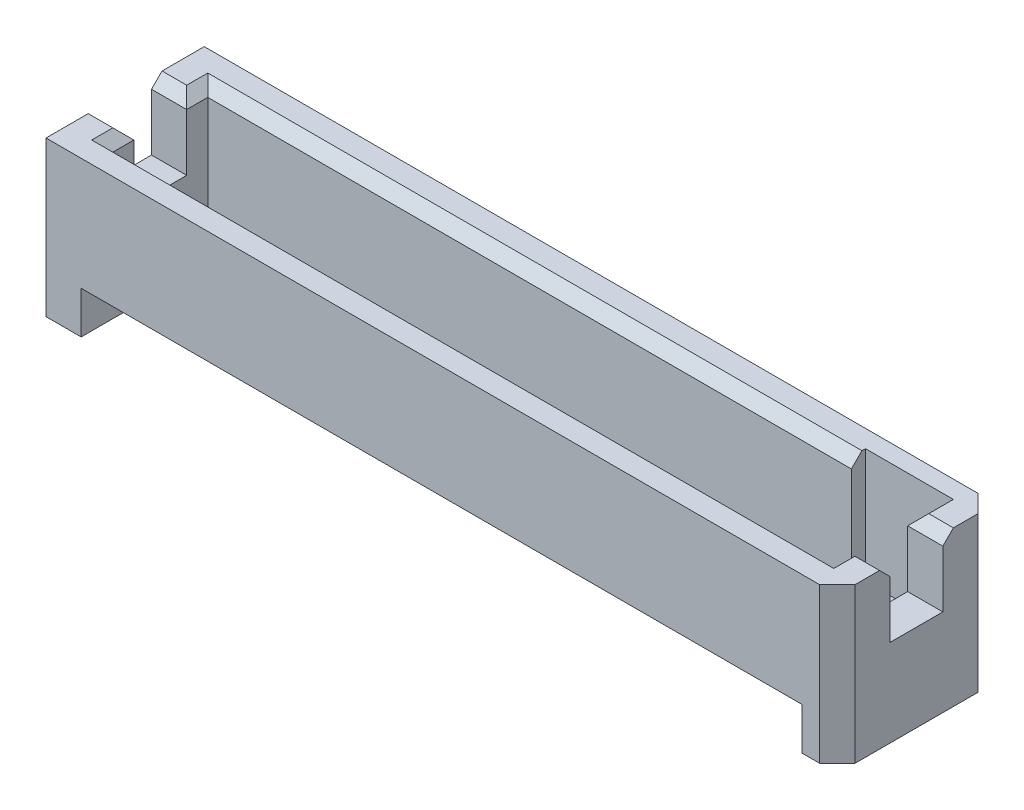
ISO-10303-21;
HEADER;
FILE_DESCRIPTION(('STEP AP214'),'2;1');
FILE_NAME('part.step','',(''),(''),'','','');
FILE_SCHEMA(('AUTOMOTIVE_DESIGN { 1 0 10303 214 1 1 1 1 }'));
ENDSEC;
DATA;
#1=APPLICATION_CONTEXT('core data for automotive mechanical design processes');
#2=APPLICATION_PROTOCOL_DEFINITION('international standard','automotive_design',2000,#1);
#3=PRODUCT_CONTEXT('',#1,'mechanical');
#4=PRODUCT('Part','Part','',(#3));
#5=PRODUCT_RELATED_PRODUCT_CATEGORY('part','',(#4));
#6=PRODUCT_DEFINITION_FORMATION('','',#4);
#7=PRODUCT_DEFINITION_CONTEXT('part definition',#1,'design');
#8=PRODUCT_DEFINITION('design','',#6,#7);
#9=PRODUCT_DEFINITION_SHAPE('','',#8);
#10=(LENGTH_UNIT() NAMED_UNIT(*) SI_UNIT(.MILLI.,.METRE.));
#11=(NAMED_UNIT(*) PLANE_ANGLE_UNIT() SI_UNIT($,.RADIAN.));
#12=(NAMED_UNIT(*) SI_UNIT($,.STERADIAN.) SOLID_ANGLE_UNIT());
#13=UNCERTAINTY_MEASURE_WITH_UNIT(LENGTH_MEASURE(1.E-05),#10,'distance_accuracy_value','');
#14=(GEOMETRIC_REPRESENTATION_CONTEXT(3) GLOBAL_UNCERTAINTY_ASSIGNED_CONTEXT((#13)) GLOBAL_UNIT_ASSIGNED_CONTEXT((#10,
#11,#12)) REPRESENTATION_CONTEXT('',''));
#15=CARTESIAN_POINT('',(0.,0.,0.));
#16=DIRECTION('',(0.,0.,1.));
#17=DIRECTION('',(1.,0.,0.));
#18=AXIS2_PLACEMENT_3D('',#15,#16,#17);
#19=CARTESIAN_POINT('',(13.6525,5.58800000000002,2.8575));
#20=DIRECTION('',(-0.707106781186545,0.,-0.707106781186547));
#21=DIRECTION('',(-0.707106781186548,0.,0.707106781186547));
#22=AXIS2_PLACEMENT_3D('',#19,#20,#21);
#23=PLANE('',#22);
#24=DIRECTION('',(0.707106781186548,0.,-0.707106781186547));
#25=VECTOR('',#24,1.);
#26=CARTESIAN_POINT('',(13.6525,0.,2.8575));
#27=LINE('',#26,#25);
#28=CARTESIAN_POINT('',(13.6525,0.,2.8575));
#29=VERTEX_POINT('',#28);
#30=CARTESIAN_POINT('',(14.2875,0.,2.2225));
#31=VERTEX_POINT('',#30);
#32=EDGE_CURVE('E11',#29,#31,#27,.T.);
#33=ORIENTED_EDGE('',*,*,#32,.T.);
#34=DIRECTION('',(0.,-1.,0.));
#35=VECTOR('',#34,1.);
#36=CARTESIAN_POINT('',(14.2875,5.588,2.2225));
#37=LINE('',#36,#35);
#38=CARTESIAN_POINT('',(14.2875,5.588,2.2225));
#39=VERTEX_POINT('',#38);
#40=EDGE_CURVE('E24',#39,#31,#37,.T.);
#41=ORIENTED_EDGE('',*,*,#40,.F.);
#42=DIRECTION('',(0.707106781186548,0.,-0.707106781186547));
#43=VECTOR('',#42,1.);
#44=CARTESIAN_POINT('',(13.6525,5.58800000000002,2.8575));
#45=LINE('',#44,#43);
#46=CARTESIAN_POINT('',(13.6525,5.58800000000002,2.8575));
#47=VERTEX_POINT('',#46);
#48=EDGE_CURVE('E660',#47,#39,#45,.T.);
#49=ORIENTED_EDGE('',*,*,#48,.F.);
#50=DIRECTION('',(0.,-1.,0.));
#51=VECTOR('',#50,1.);
#52=CARTESIAN_POINT('',(13.6525,5.58800000000002,2.8575));
#53=LINE('',#52,#51);
#54=EDGE_CURVE('E656',#47,#29,#53,.T.);
#55=ORIENTED_EDGE('',*,*,#54,.T.);
#56=EDGE_LOOP('',(#33,#41,#49,#55));
#57=FACE_BOUND('',#56,.T.);
#58=ADVANCED_FACE('F16',(#57),#23,.F.);
#59=CARTESIAN_POINT('',(-14.2875,5.58800000000002,2.85750000000001));
#60=DIRECTION('',(0.,0.,-1.));
#61=DIRECTION('',(-0.999999999999999,0.,0.));
#62=AXIS2_PLACEMENT_3D('',#59,#60,#61);
#63=PLANE('',#62);
#64=DIRECTION('',(-0.999999999999999,0.,0.));
#65=VECTOR('',#64,1.);
#66=CARTESIAN_POINT('',(13.0175,1.52400000000002,2.8575));
#67=LINE('',#66,#65);
#68=CARTESIAN_POINT('',(13.0175,1.52400000000002,2.8575));
#69=VERTEX_POINT('',#68);
#70=CARTESIAN_POINT('',(-13.0175,1.524,2.85750000000004));
#71=VERTEX_POINT('',#70);
#72=EDGE_CURVE('E651',#69,#71,#67,.T.);
#73=ORIENTED_EDGE('',*,*,#72,.F.);
#74=DIRECTION('',(0.,-1.,0.));
#75=VECTOR('',#74,1.);
#76=CARTESIAN_POINT('',(13.0175,1.52400000000002,2.8575));
#77=LINE('',#76,#75);
#78=CARTESIAN_POINT('',(13.0175,0.,2.8575));
#79=VERTEX_POINT('',#78);
#80=EDGE_CURVE('E647',#69,#79,#77,.T.);
#81=ORIENTED_EDGE('',*,*,#80,.T.);
#82=DIRECTION('',(0.999999999999999,0.,0.));
#83=VECTOR('',#82,1.);
#84=CARTESIAN_POINT('',(-14.2875,0.,2.85750000000004));
#85=LINE('',#84,#83);
#86=EDGE_CURVE('E642',#79,#29,#85,.T.);
#87=ORIENTED_EDGE('',*,*,#86,.T.);
#88=ORIENTED_EDGE('',*,*,#54,.F.);
#89=DIRECTION('',(0.999999999999999,0.,0.));
#90=VECTOR('',#89,1.);
#91=CARTESIAN_POINT('',(-14.2875,5.58800000000002,2.85750000000001));
#92=LINE('',#91,#90);
#93=CARTESIAN_POINT('',(-14.2875,5.58800000000002,2.85750000000001));
#94=VERTEX_POINT('',#93);
#95=EDGE_CURVE('E637',#94,#47,#92,.T.);
#96=ORIENTED_EDGE('',*,*,#95,.F.);
#97=DIRECTION('',(0.,-1.,0.));
#98=VECTOR('',#97,1.);
#99=CARTESIAN_POINT('',(-14.2875,5.58800000000002,2.85750000000001));
#100=LINE('',#99,#98);
#101=CARTESIAN_POINT('',(-14.2875,0.,2.85750000000004));
#102=VERTEX_POINT('',#101);
#103=EDGE_CURVE('E633',#94,#102,#100,.T.);
#104=ORIENTED_EDGE('',*,*,#103,.T.);
#105=DIRECTION('',(0.999999999999999,0.,0.));
#106=VECTOR('',#105,1.);
#107=CARTESIAN_POINT('',(-14.2875,0.,2.85750000000004));
#108=LINE('',#107,#106);
#109=CARTESIAN_POINT('',(-13.0175,0.,2.85750000000004));
#110=VERTEX_POINT('',#109);
#111=EDGE_CURVE('E629',#102,#110,#108,.T.);
#112=ORIENTED_EDGE('',*,*,#111,.T.);
#113=DIRECTION('',(0.,-1.,0.));
#114=VECTOR('',#113,1.);
#115=CARTESIAN_POINT('',(-13.0175,1.524,2.85750000000004));
#116=LINE('',#115,#114);
#117=EDGE_CURVE('E624',#71,#110,#116,.T.);
#118=ORIENTED_EDGE('',*,*,#117,.F.);
#119=EDGE_LOOP('',(#73,#81,#87,#88,#96,#104,#112,#118));
#120=FACE_BOUND('',#119,.T.);
#121=ADVANCED_FACE('F676',(#120),#63,.F.);
#122=CARTESIAN_POINT('',(-13.0175,0.,0.));
#123=DIRECTION('',(0.999999999999999,0.,0.));
#124=DIRECTION('',(0.,0.,-1.));
#125=AXIS2_PLACEMENT_3D('',#122,#123,#124);
#126=PLANE('',#125);
#127=DIRECTION('',(0.,0.496138938356834,0.868243142124459));
#128=VECTOR('',#127,1.);
#129=CARTESIAN_POINT('',(-13.0175,0.507999999999981,1.07950000000002));
#130=LINE('',#129,#128);
#131=CARTESIAN_POINT('',(-13.0175,0.507999999999981,1.07950000000002));
#132=VERTEX_POINT('',#131);
#133=EDGE_CURVE('E619',#132,#71,#130,.T.);
#134=ORIENTED_EDGE('',*,*,#133,.T.);
#135=ORIENTED_EDGE('',*,*,#117,.T.);
#136=DIRECTION('',(0.,0.,-1.));
#137=VECTOR('',#136,1.);
#138=CARTESIAN_POINT('',(-13.0175,0.,2.85750000000004));
#139=LINE('',#138,#137);
#140=CARTESIAN_POINT('',(-13.0175,0.,-2.85749999999996));
#141=VERTEX_POINT('',#140);
#142=EDGE_CURVE('E615',#110,#141,#139,.T.);
#143=ORIENTED_EDGE('',*,*,#142,.T.);
#144=DIRECTION('',(0.,1.,0.));
#145=VECTOR('',#144,1.);
#146=CARTESIAN_POINT('',(-13.0175,0.,-2.85749999999996));
#147=LINE('',#146,#145);
#148=CARTESIAN_POINT('',(-13.0175,1.524,-2.85749999999996));
#149=VERTEX_POINT('',#148);
#150=EDGE_CURVE('E611',#141,#149,#147,.T.);
#151=ORIENTED_EDGE('',*,*,#150,.T.);
#152=DIRECTION('',(0.,-0.496138938356834,0.868243142124459));
#153=VECTOR('',#152,1.);
#154=CARTESIAN_POINT('',(-13.0175,1.524,-2.85749999999996));
#155=LINE('',#154,#153);
#156=CARTESIAN_POINT('',(-13.0175,0.508000000000002,-1.07949999999997));
#157=VERTEX_POINT('',#156);
#158=EDGE_CURVE('E607',#149,#157,#155,.T.);
#159=ORIENTED_EDGE('',*,*,#158,.T.);
#160=DIRECTION('',(0.,0.,1.));
#161=VECTOR('',#160,1.);
#162=CARTESIAN_POINT('',(-13.0175,0.508000000000002,-1.07949999999997));
#163=LINE('',#162,#161);
#164=EDGE_CURVE('E603',#157,#132,#163,.T.);
#165=ORIENTED_EDGE('',*,*,#164,.T.);
#166=EDGE_LOOP('',(#134,#135,#143,#151,#159,#165));
#167=FACE_BOUND('',#166,.T.);
#168=ADVANCED_FACE('F806',(#167),#126,.T.);
#169=CARTESIAN_POINT('',(13.0175,0.508000000000029,-1.0795));
#170=DIRECTION('',(0.,-1.,0.));
#171=DIRECTION('',(0.,0.,-1.));
#172=AXIS2_PLACEMENT_3D('',#169,#170,#171);
#173=PLANE('',#172);
#174=ORIENTED_EDGE('',*,*,#164,.F.);
#175=DIRECTION('',(-0.999999999999999,0.,0.));
#176=VECTOR('',#175,1.);
#177=CARTESIAN_POINT('',(13.0175,0.508000000000029,-1.0795));
#178=LINE('',#177,#176);
#179=CARTESIAN_POINT('',(13.0175,0.508000000000029,-1.0795));
#180=VERTEX_POINT('',#179);
#181=EDGE_CURVE('E598',#180,#157,#178,.T.);
#182=ORIENTED_EDGE('',*,*,#181,.F.);
#183=DIRECTION('',(0.,0.,1.));
#184=VECTOR('',#183,1.);
#185=CARTESIAN_POINT('',(13.0175,0.508000000000029,-1.0795));
#186=LINE('',#185,#184);
#187=CARTESIAN_POINT('',(13.0175,0.508000000000008,1.0795));
#188=VERTEX_POINT('',#187);
#189=EDGE_CURVE('E594',#180,#188,#186,.T.);
#190=ORIENTED_EDGE('',*,*,#189,.T.);
#191=DIRECTION('',(-0.999999999999999,0.,0.));
#192=VECTOR('',#191,1.);
#193=CARTESIAN_POINT('',(13.0175,0.508000000000008,1.0795));
#194=LINE('',#193,#192);
#195=EDGE_CURVE('E589',#188,#132,#194,.T.);
#196=ORIENTED_EDGE('',*,*,#195,.T.);
#197=EDGE_LOOP('',(#174,#182,#190,#196));
#198=FACE_BOUND('',#197,.T.);
#199=ADVANCED_FACE('F810',(#198),#173,.T.);
#200=CARTESIAN_POINT('',(13.0175,0.508000000000008,1.0795));
#201=DIRECTION('',(0.,-0.868243142124459,0.496138938356834));
#202=DIRECTION('',(0.,-0.496138938356834,-0.868243142124459));
#203=AXIS2_PLACEMENT_3D('',#200,#201,#202);
#204=PLANE('',#203);
#205=ORIENTED_EDGE('',*,*,#133,.F.);
#206=ORIENTED_EDGE('',*,*,#195,.F.);
#207=DIRECTION('',(0.,0.496138938356834,0.868243142124459));
#208=VECTOR('',#207,1.);
#209=CARTESIAN_POINT('',(13.0175,0.508000000000008,1.0795));
#210=LINE('',#209,#208);
#211=EDGE_CURVE('E584',#188,#69,#210,.T.);
#212=ORIENTED_EDGE('',*,*,#211,.T.);
#213=ORIENTED_EDGE('',*,*,#72,.T.);
#214=EDGE_LOOP('',(#205,#206,#212,#213));
#215=FACE_BOUND('',#214,.T.);
#216=ADVANCED_FACE('F816',(#215),#204,.T.);
#217=CARTESIAN_POINT('',(13.0175,0.,0.));
#218=DIRECTION('',(0.999999999999999,0.,0.));
#219=DIRECTION('',(0.,0.,-1.));
#220=AXIS2_PLACEMENT_3D('',#217,#218,#219);
#221=PLANE('',#220);
#222=ORIENTED_EDGE('',*,*,#211,.F.);
#223=ORIENTED_EDGE('',*,*,#189,.F.);
#224=DIRECTION('',(0.,-0.496138938356834,0.868243142124459));
#225=VECTOR('',#224,1.);
#226=CARTESIAN_POINT('',(13.0175,1.524,-2.8575));
#227=LINE('',#226,#225);
#228=CARTESIAN_POINT('',(13.0175,1.524,-2.8575));
#229=VERTEX_POINT('',#228);
#230=EDGE_CURVE('E579',#229,#180,#227,.T.);
#231=ORIENTED_EDGE('',*,*,#230,.F.);
#232=DIRECTION('',(0.,1.,0.));
#233=VECTOR('',#232,1.);
#234=CARTESIAN_POINT('',(13.0175,0.,-2.8575));
#235=LINE('',#234,#233);
#236=CARTESIAN_POINT('',(13.0175,0.,-2.8575));
#237=VERTEX_POINT('',#236);
#238=EDGE_CURVE('E574',#237,#229,#235,.T.);
#239=ORIENTED_EDGE('',*,*,#238,.F.);
#240=DIRECTION('',(0.,0.,-1.));
#241=VECTOR('',#240,1.);
#242=CARTESIAN_POINT('',(13.0175,0.,2.8575));
#243=LINE('',#242,#241);
#244=EDGE_CURVE('E569',#79,#237,#243,.T.);
#245=ORIENTED_EDGE('',*,*,#244,.F.);
#246=ORIENTED_EDGE('',*,*,#80,.F.);
#247=EDGE_LOOP('',(#222,#223,#231,#239,#245,#246));
#248=FACE_BOUND('',#247,.T.);
#249=ADVANCED_FACE('F820',(#248),#221,.F.);
#250=CARTESIAN_POINT('',(0.,0.,0.));
#251=DIRECTION('',(0.,1.,0.));
#252=DIRECTION('',(0.,0.,1.));
#253=AXIS2_PLACEMENT_3D('',#250,#251,#252);
#254=PLANE('',#253);
#255=ORIENTED_EDGE('',*,*,#86,.F.);
#256=ORIENTED_EDGE('',*,*,#244,.T.);
#257=DIRECTION('',(-0.999999999999999,0.,0.));
#258=VECTOR('',#257,1.);
#259=CARTESIAN_POINT('',(13.6525,0.,-2.8575));
#260=LINE('',#259,#258);
#261=CARTESIAN_POINT('',(13.6525,0.,-2.8575));
#262=VERTEX_POINT('',#261);
#263=EDGE_CURVE('E564',#262,#237,#260,.T.);
#264=ORIENTED_EDGE('',*,*,#263,.F.);
#265=DIRECTION('',(-0.707106781186546,0.,-0.707106781186546));
#266=VECTOR('',#265,1.);
#267=CARTESIAN_POINT('',(14.2875,0.,-2.2225));
#268=LINE('',#267,#266);
#269=CARTESIAN_POINT('',(14.2875,0.,-2.2225));
#270=VERTEX_POINT('',#269);
#271=EDGE_CURVE('E559',#270,#262,#268,.T.);
#272=ORIENTED_EDGE('',*,*,#271,.F.);
#273=DIRECTION('',(0.,0.,-1.));
#274=VECTOR('',#273,1.);
#275=CARTESIAN_POINT('',(14.2875,0.,2.2225));
#276=LINE('',#275,#274);
#277=EDGE_CURVE('E554',#31,#270,#276,.T.);
#278=ORIENTED_EDGE('',*,*,#277,.F.);
#279=ORIENTED_EDGE('',*,*,#32,.F.);
#280=EDGE_LOOP('',(#255,#256,#264,#272,#278,#279));
#281=FACE_BOUND('',#280,.T.);
#282=ADVANCED_FACE('F681',(#281),#254,.F.);
#283=CARTESIAN_POINT('',(14.2875,5.588,2.2225));
#284=DIRECTION('',(-0.999999999999999,0.,0.));
#285=DIRECTION('',(0.,0.,1.));
#286=AXIS2_PLACEMENT_3D('',#283,#284,#285);
#287=PLANE('',#286);
#288=DIRECTION('',(0.,-0.707106781186548,-0.707106781186547));
#289=VECTOR('',#288,1.);
#290=CARTESIAN_POINT('',(14.2875,5.588,1.3335));
#291=LINE('',#290,#289);
#292=CARTESIAN_POINT('',(14.2875,5.588,1.3335));
#293=VERTEX_POINT('',#292);
#294=CARTESIAN_POINT('',(14.2875,5.207,0.952500000000009));
#295=VERTEX_POINT('',#294);
#296=EDGE_CURVE('E549',#293,#295,#291,.T.);
#297=ORIENTED_EDGE('',*,*,#296,.F.);
#298=DIRECTION('',(0.,0.,-1.));
#299=VECTOR('',#298,1.);
#300=CARTESIAN_POINT('',(14.2875,5.588,2.2225));
#301=LINE('',#300,#299);
#302=EDGE_CURVE('E544',#39,#293,#301,.T.);
#303=ORIENTED_EDGE('',*,*,#302,.F.);
#304=ORIENTED_EDGE('',*,*,#40,.T.);
#305=ORIENTED_EDGE('',*,*,#277,.T.);
#306=DIRECTION('',(0.,-1.,0.));
#307=VECTOR('',#306,1.);
#308=CARTESIAN_POINT('',(14.2875,5.58799999999998,-2.2225));
#309=LINE('',#308,#307);
#310=CARTESIAN_POINT('',(14.2875,5.58799999999998,-2.2225));
#311=VERTEX_POINT('',#310);
#312=EDGE_CURVE('E539',#311,#270,#309,.T.);
#313=ORIENTED_EDGE('',*,*,#312,.F.);
#314=DIRECTION('',(0.,0.,-1.));
#315=VECTOR('',#314,1.);
#316=CARTESIAN_POINT('',(14.2875,5.588,2.2225));
#317=LINE('',#316,#315);
#318=CARTESIAN_POINT('',(14.2875,5.588,-1.3335));
#319=VERTEX_POINT('',#318);
#320=EDGE_CURVE('E534',#319,#311,#317,.T.);
#321=ORIENTED_EDGE('',*,*,#320,.F.);
#322=DIRECTION('',(0.,0.707106781186548,-0.707106781186547));
#323=VECTOR('',#322,1.);
#324=CARTESIAN_POINT('',(14.2875,5.20699999999999,-0.952499999999995));
#325=LINE('',#324,#323);
#326=CARTESIAN_POINT('',(14.2875,5.20699999999999,-0.952499999999995));
#327=VERTEX_POINT('',#326);
#328=EDGE_CURVE('E529',#327,#319,#325,.T.);
#329=ORIENTED_EDGE('',*,*,#328,.F.);
#330=DIRECTION('',(0.,-1.,0.));
#331=VECTOR('',#330,1.);
#332=CARTESIAN_POINT('',(14.2875,8.02639999999999,-0.952499999999995));
#333=LINE('',#332,#331);
#334=CARTESIAN_POINT('',(14.2875,3.14959999999999,-0.952499999999995));
#335=VERTEX_POINT('',#334);
#336=EDGE_CURVE('E525',#327,#335,#333,.T.);
#337=ORIENTED_EDGE('',*,*,#336,.T.);
#338=DIRECTION('',(0.,0.,-1.));
#339=VECTOR('',#338,1.);
#340=CARTESIAN_POINT('',(14.2875,3.1496,0.952500000000009));
#341=LINE('',#340,#339);
#342=CARTESIAN_POINT('',(14.2875,3.1496,0.952500000000009));
#343=VERTEX_POINT('',#342);
#344=EDGE_CURVE('E520',#343,#335,#341,.T.);
#345=ORIENTED_EDGE('',*,*,#344,.F.);
#346=DIRECTION('',(0.,-1.,0.));
#347=VECTOR('',#346,1.);
#348=CARTESIAN_POINT('',(14.2875,8.0264,0.952500000000009));
#349=LINE('',#348,#347);
#350=EDGE_CURVE('E515',#295,#343,#349,.T.);
#351=ORIENTED_EDGE('',*,*,#350,.F.);
#352=EDGE_LOOP('',(#297,#303,#304,#305,#313,#321,#329,#337,#345,#351));
#353=FACE_BOUND('',#352,.T.);
#354=ADVANCED_FACE('F670',(#353),#287,.F.);
#355=CARTESIAN_POINT('',(-14.2875,8.02640000000003,0.952500000000023));
#356=DIRECTION('',(0.,0.,-1.));
#357=DIRECTION('',(-0.999999999999999,0.,0.));
#358=AXIS2_PLACEMENT_3D('',#355,#356,#357);
#359=PLANE('',#358);
#360=DIRECTION('',(0.,-1.,0.));
#361=VECTOR('',#360,1.);
#362=CARTESIAN_POINT('',(13.0175,8.02640000000002,0.952500000000009));
#363=LINE('',#362,#361);
#364=CARTESIAN_POINT('',(13.0175,5.20700000000002,0.952500000000009));
#365=VERTEX_POINT('',#364);
#366=CARTESIAN_POINT('',(13.0175,3.14960000000002,0.952500000000009));
#367=VERTEX_POINT('',#366);
#368=EDGE_CURVE('E510',#365,#367,#363,.T.);
#369=ORIENTED_EDGE('',*,*,#368,.F.);
#370=DIRECTION('',(-0.999999999999999,0.,0.));
#371=VECTOR('',#370,1.);
#372=CARTESIAN_POINT('',(14.2875,5.207,0.952500000000009));
#373=LINE('',#372,#371);
#374=EDGE_CURVE('E505',#295,#365,#373,.T.);
#375=ORIENTED_EDGE('',*,*,#374,.F.);
#376=ORIENTED_EDGE('',*,*,#350,.T.);
#377=DIRECTION('',(0.999999999999999,0.,0.));
#378=VECTOR('',#377,1.);
#379=CARTESIAN_POINT('',(-14.2875,3.14960000000003,0.952500000000023));
#380=LINE('',#379,#378);
#381=EDGE_CURVE('E500',#367,#343,#380,.T.);
#382=ORIENTED_EDGE('',*,*,#381,.F.);
#383=EDGE_LOOP('',(#369,#375,#376,#382));
#384=FACE_BOUND('',#383,.T.);
#385=ADVANCED_FACE('F790',(#384),#359,.T.);
#386=CARTESIAN_POINT('',(0.,3.1496,0.));
#387=DIRECTION('',(0.,1.,0.));
#388=DIRECTION('',(0.,0.,1.));
#389=AXIS2_PLACEMENT_3D('',#386,#387,#388);
#390=PLANE('',#389);
#391=DIRECTION('',(0.,0.,-1.));
#392=VECTOR('',#391,1.);
#393=CARTESIAN_POINT('',(13.0175,3.14960000000001,0.));
#394=LINE('',#393,#392);
#395=CARTESIAN_POINT('',(13.0175,3.14960000000002,-0.952499999999995));
#396=VERTEX_POINT('',#395);
#397=EDGE_CURVE('E495',#367,#396,#394,.T.);
#398=ORIENTED_EDGE('',*,*,#397,.F.);
#399=ORIENTED_EDGE('',*,*,#381,.T.);
#400=ORIENTED_EDGE('',*,*,#344,.T.);
#401=DIRECTION('',(-0.999999999999999,0.,0.));
#402=VECTOR('',#401,1.);
#403=CARTESIAN_POINT('',(14.2875,3.14959999999999,-0.952499999999995));
#404=LINE('',#403,#402);
#405=EDGE_CURVE('E491',#335,#396,#404,.T.);
#406=ORIENTED_EDGE('',*,*,#405,.T.);
#407=EDGE_LOOP('',(#398,#399,#400,#406));
#408=FACE_BOUND('',#407,.T.);
#409=ADVANCED_FACE('F792',(#408),#390,.T.);
#410=CARTESIAN_POINT('',(14.2875,8.02639999999999,-0.952499999999995));
#411=DIRECTION('',(0.,0.,1.));
#412=DIRECTION('',(0.999999999999999,0.,0.));
#413=AXIS2_PLACEMENT_3D('',#410,#411,#412);
#414=PLANE('',#413);
#415=ORIENTED_EDGE('',*,*,#336,.F.);
#416=DIRECTION('',(-0.999999999999999,0.,0.));
#417=VECTOR('',#416,1.);
#418=CARTESIAN_POINT('',(14.2875,5.20699999999999,-0.952499999999995));
#419=LINE('',#418,#417);
#420=CARTESIAN_POINT('',(13.0175,5.20700000000002,-0.952499999999995));
#421=VERTEX_POINT('',#420);
#422=EDGE_CURVE('E487',#327,#421,#419,.T.);
#423=ORIENTED_EDGE('',*,*,#422,.T.);
#424=DIRECTION('',(0.,1.,0.));
#425=VECTOR('',#424,1.);
#426=CARTESIAN_POINT('',(13.0175,8.02640000000002,-0.952499999999995));
#427=LINE('',#426,#425);
#428=EDGE_CURVE('E482',#396,#421,#427,.T.);
#429=ORIENTED_EDGE('',*,*,#428,.F.);
#430=ORIENTED_EDGE('',*,*,#405,.F.);
#431=EDGE_LOOP('',(#415,#423,#429,#430));
#432=FACE_BOUND('',#431,.T.);
#433=ADVANCED_FACE('F697',(#432),#414,.T.);
#434=CARTESIAN_POINT('',(13.0175,1.43510000000002,1.71450000000001));
#435=DIRECTION('',(0.999999999999999,0.,0.));
#436=DIRECTION('',(0.,0.,-1.));
#437=AXIS2_PLACEMENT_3D('',#434,#435,#436);
#438=PLANE('',#437);
#439=ORIENTED_EDGE('',*,*,#397,.T.);
#440=ORIENTED_EDGE('',*,*,#428,.T.);
#441=DIRECTION('',(0.,0.,-1.));
#442=VECTOR('',#441,1.);
#443=CARTESIAN_POINT('',(13.0175,5.20700000000002,1.71450000000001));
#444=LINE('',#443,#442);
#445=CARTESIAN_POINT('',(13.0175,5.207,-2.2225));
#446=VERTEX_POINT('',#445);
#447=EDGE_CURVE('E478',#421,#446,#444,.T.);
#448=ORIENTED_EDGE('',*,*,#447,.T.);
#449=DIRECTION('',(0.,1.,0.));
#450=VECTOR('',#449,1.);
#451=CARTESIAN_POINT('',(13.0175,1.43510000000001,-2.2225));
#452=LINE('',#451,#450);
#453=CARTESIAN_POINT('',(13.0175,1.43510000000001,-2.2225));
#454=VERTEX_POINT('',#453);
#455=EDGE_CURVE('E474',#454,#446,#452,.T.);
#456=ORIENTED_EDGE('',*,*,#455,.F.);
#457=DIRECTION('',(0.,0.,-1.));
#458=VECTOR('',#457,1.);
#459=CARTESIAN_POINT('',(13.0175,1.43510000000002,1.71450000000001));
#460=LINE('',#459,#458);
#461=CARTESIAN_POINT('',(13.0175,1.43510000000002,1.71450000000001));
#462=VERTEX_POINT('',#461);
#463=EDGE_CURVE('E232',#462,#454,#460,.T.);
#464=ORIENTED_EDGE('',*,*,#463,.F.);
#465=DIRECTION('',(0.,1.,0.));
#466=VECTOR('',#465,1.);
#467=CARTESIAN_POINT('',(13.0175,1.43510000000002,1.71450000000001));
#468=LINE('',#467,#466);
#469=CARTESIAN_POINT('',(13.0175,5.20700000000002,1.71450000000001));
#470=VERTEX_POINT('',#469);
#471=EDGE_CURVE('E467',#462,#470,#468,.T.);
#472=ORIENTED_EDGE('',*,*,#471,.T.);
#473=DIRECTION('',(0.,0.,-1.));
#474=VECTOR('',#473,1.);
#475=CARTESIAN_POINT('',(13.0175,5.20700000000002,1.71450000000001));
#476=LINE('',#475,#474);
#477=EDGE_CURVE('E462',#470,#365,#476,.T.);
#478=ORIENTED_EDGE('',*,*,#477,.T.);
#479=ORIENTED_EDGE('',*,*,#368,.T.);
#480=EDGE_LOOP('',(#439,#440,#448,#456,#464,#472,#478,#479));
#481=FACE_BOUND('',#480,.T.);
#482=ADVANCED_FACE('F701',(#481),#438,.F.);
#483=CARTESIAN_POINT('',(13.0175,5.20700000000002,1.71450000000001));
#484=DIRECTION('',(-0.707106781186547,0.707106781186547,0.));
#485=DIRECTION('',(-0.707106781186547,-0.707106781186547,0.));
#486=AXIS2_PLACEMENT_3D('',#483,#484,#485);
#487=PLANE('',#486);
#488=DIRECTION('',(0.,0.,-1.));
#489=VECTOR('',#488,1.);
#490=CARTESIAN_POINT('',(13.3985,5.58800000000002,1.71450000000001));
#491=LINE('',#490,#489);
#492=CARTESIAN_POINT('',(13.3985,5.588,2.0955));
#493=VERTEX_POINT('',#492);
#494=CARTESIAN_POINT('',(13.3985,5.588,1.3335));
#495=VERTEX_POINT('',#494);
#496=EDGE_CURVE('E458',#493,#495,#491,.T.);
#497=ORIENTED_EDGE('',*,*,#496,.T.);
#498=DIRECTION('',(-0.577350269189625,-0.577350269189626,-0.577350269189624));
#499=VECTOR('',#498,1.);
#500=CARTESIAN_POINT('',(13.2715,5.461,1.2065));
#501=LINE('',#500,#499);
#502=EDGE_CURVE('E453',#495,#365,#501,.T.);
#503=ORIENTED_EDGE('',*,*,#502,.T.);
#504=ORIENTED_EDGE('',*,*,#477,.F.);
#505=DIRECTION('',(-0.577350269189624,-0.577350269189625,-0.577350269189625));
#506=VECTOR('',#505,1.);
#507=CARTESIAN_POINT('',(13.0175,5.20700000000002,1.71450000000001));
#508=LINE('',#507,#506);
#509=EDGE_CURVE('E448',#493,#470,#508,.T.);
#510=ORIENTED_EDGE('',*,*,#509,.F.);
#511=EDGE_LOOP('',(#497,#503,#504,#510));
#512=FACE_BOUND('',#511,.T.);
#513=ADVANCED_FACE('F787',(#512),#487,.T.);
#514=CARTESIAN_POINT('',(-13.0175,5.207,1.71450000000002));
#515=DIRECTION('',(0.,0.707106781186547,-0.707106781186547));
#516=DIRECTION('',(0.,0.707106781186547,0.707106781186547));
#517=AXIS2_PLACEMENT_3D('',#514,#515,#516);
#518=PLANE('',#517);
#519=DIRECTION('',(0.999999999999999,0.,0.));
#520=VECTOR('',#519,1.);
#521=CARTESIAN_POINT('',(-13.0175,5.207,1.71450000000002));
#522=LINE('',#521,#520);
#523=CARTESIAN_POINT('',(-13.0175,5.207,1.71450000000002));
#524=VERTEX_POINT('',#523);
#525=EDGE_CURVE('E443',#524,#470,#522,.T.);
#526=ORIENTED_EDGE('',*,*,#525,.F.);
#527=DIRECTION('',(0.577350269189626,-0.577350269189625,-0.577350269189626));
#528=VECTOR('',#527,1.);
#529=CARTESIAN_POINT('',(-13.0175,5.207,1.71450000000002));
#530=LINE('',#529,#528);
#531=CARTESIAN_POINT('',(-13.3985,5.588,2.09550000000001));
#532=VERTEX_POINT('',#531);
#533=EDGE_CURVE('E438',#532,#524,#530,.T.);
#534=ORIENTED_EDGE('',*,*,#533,.F.);
#535=DIRECTION('',(0.999999999999999,0.,0.));
#536=VECTOR('',#535,1.);
#537=CARTESIAN_POINT('',(-13.0175,5.58800000000001,2.09550000000001));
#538=LINE('',#537,#536);
#539=EDGE_CURVE('E433',#532,#493,#538,.T.);
#540=ORIENTED_EDGE('',*,*,#539,.T.);
#541=ORIENTED_EDGE('',*,*,#509,.T.);
#542=EDGE_LOOP('',(#526,#534,#540,#541));
#543=FACE_BOUND('',#542,.T.);
#544=ADVANCED_FACE('F713',(#543),#518,.T.);
#545=CARTESIAN_POINT('',(0.,5.588,0.));
#546=DIRECTION('',(0.,1.,0.));
#547=DIRECTION('',(0.,0.,1.));
#548=AXIS2_PLACEMENT_3D('',#545,#546,#547);
#549=PLANE('',#548);
#550=ORIENTED_EDGE('',*,*,#302,.T.);
#551=DIRECTION('',(-0.999999999999999,0.,0.));
#552=VECTOR('',#551,1.);
#553=CARTESIAN_POINT('',(14.2875,5.588,1.3335));
#554=LINE('',#553,#552);
#555=EDGE_CURVE('E428',#293,#495,#554,.T.);
#556=ORIENTED_EDGE('',*,*,#555,.T.);
#557=ORIENTED_EDGE('',*,*,#496,.F.);
#558=ORIENTED_EDGE('',*,*,#539,.F.);
#559=DIRECTION('',(0.,0.,1.));
#560=VECTOR('',#559,1.);
#561=CARTESIAN_POINT('',(-13.3985,5.588,-1.71449999999998));
#562=LINE('',#561,#560);
#563=CARTESIAN_POINT('',(-13.3985,5.588,1.33350000000002));
#564=VERTEX_POINT('',#563);
#565=EDGE_CURVE('E423',#564,#532,#562,.T.);
#566=ORIENTED_EDGE('',*,*,#565,.F.);
#567=DIRECTION('',(-0.999999999999999,0.,0.));
#568=VECTOR('',#567,1.);
#569=CARTESIAN_POINT('',(14.2875,5.588,1.3335));
#570=LINE('',#569,#568);
#571=CARTESIAN_POINT('',(-14.2875,5.58800000000001,1.33350000000002));
#572=VERTEX_POINT('',#571);
#573=EDGE_CURVE('E419',#564,#572,#570,.T.);
#574=ORIENTED_EDGE('',*,*,#573,.T.);
#575=DIRECTION('',(0.,0.,1.));
#576=VECTOR('',#575,1.);
#577=CARTESIAN_POINT('',(-14.2875,5.58800000000001,-2.85749999999998));
#578=LINE('',#577,#576);
#579=EDGE_CURVE('E414',#572,#94,#578,.T.);
#580=ORIENTED_EDGE('',*,*,#579,.T.);
#581=ORIENTED_EDGE('',*,*,#95,.T.);
#582=ORIENTED_EDGE('',*,*,#48,.T.);
#583=EDGE_LOOP('',(#550,#556,#557,#558,#566,#574,#580,#581,#582));
#584=FACE_BOUND('',#583,.T.);
#585=ADVANCED_FACE('F673',(#584),#549,.T.);
#586=CARTESIAN_POINT('',(-14.2875,5.58800000000001,-2.85749999999998));
#587=DIRECTION('',(0.999999999999999,0.,0.));
#588=DIRECTION('',(0.,0.,-1.));
#589=AXIS2_PLACEMENT_3D('',#586,#587,#588);
#590=PLANE('',#589);
#591=DIRECTION('',(0.,-0.707106781186548,-0.707106781186547));
#592=VECTOR('',#591,1.);
#593=CARTESIAN_POINT('',(-14.2875,5.58800000000001,1.33350000000002));
#594=LINE('',#593,#592);
#595=CARTESIAN_POINT('',(-14.2875,5.20700000000003,0.952500000000023));
#596=VERTEX_POINT('',#595);
#597=EDGE_CURVE('E410',#572,#596,#594,.T.);
#598=ORIENTED_EDGE('',*,*,#597,.T.);
#599=DIRECTION('',(0.,-1.,0.));
#600=VECTOR('',#599,1.);
#601=CARTESIAN_POINT('',(-14.2875,8.02640000000003,0.952500000000023));
#602=LINE('',#601,#600);
#603=CARTESIAN_POINT('',(-14.2875,3.14960000000003,0.952500000000023));
#604=VERTEX_POINT('',#603);
#605=EDGE_CURVE('E406',#596,#604,#602,.T.);
#606=ORIENTED_EDGE('',*,*,#605,.T.);
#607=DIRECTION('',(0.,0.,1.));
#608=VECTOR('',#607,1.);
#609=CARTESIAN_POINT('',(-14.2875,3.14960000000002,-0.952499999999981));
#610=LINE('',#609,#608);
#611=CARTESIAN_POINT('',(-14.2875,3.14960000000002,-0.952499999999981));
#612=VERTEX_POINT('',#611);
#613=EDGE_CURVE('E401',#612,#604,#610,.T.);
#614=ORIENTED_EDGE('',*,*,#613,.F.);
#615=DIRECTION('',(0.,-1.,0.));
#616=VECTOR('',#615,1.);
#617=CARTESIAN_POINT('',(-14.2875,8.02640000000002,-0.952499999999981));
#618=LINE('',#617,#616);
#619=CARTESIAN_POINT('',(-14.2875,5.20700000000002,-0.952499999999981));
#620=VERTEX_POINT('',#619);
#621=EDGE_CURVE('E396',#620,#612,#618,.T.);
#622=ORIENTED_EDGE('',*,*,#621,.F.);
#623=DIRECTION('',(0.,0.707106781186548,-0.707106781186547));
#624=VECTOR('',#623,1.);
#625=CARTESIAN_POINT('',(-14.2875,5.20700000000002,-0.952499999999981));
#626=LINE('',#625,#624);
#627=CARTESIAN_POINT('',(-14.2875,5.58800000000001,-1.33349999999999));
#628=VERTEX_POINT('',#627);
#629=EDGE_CURVE('E392',#620,#628,#626,.T.);
#630=ORIENTED_EDGE('',*,*,#629,.T.);
#631=DIRECTION('',(0.,0.,1.));
#632=VECTOR('',#631,1.);
#633=CARTESIAN_POINT('',(-14.2875,5.58800000000001,-2.85749999999998));
#634=LINE('',#633,#632);
#635=CARTESIAN_POINT('',(-14.2875,5.58800000000001,-2.85749999999998));
#636=VERTEX_POINT('',#635);
#637=EDGE_CURVE('E387',#636,#628,#634,.T.);
#638=ORIENTED_EDGE('',*,*,#637,.F.);
#639=DIRECTION('',(0.,-1.,0.));
#640=VECTOR('',#639,1.);
#641=CARTESIAN_POINT('',(-14.2875,5.58800000000001,-2.85749999999998));
#642=LINE('',#641,#640);
#643=CARTESIAN_POINT('',(-14.2875,0.,-2.85749999999996));
#644=VERTEX_POINT('',#643);
#645=EDGE_CURVE('E383',#636,#644,#642,.T.);
#646=ORIENTED_EDGE('',*,*,#645,.T.);
#647=DIRECTION('',(0.,0.,1.));
#648=VECTOR('',#647,1.);
#649=CARTESIAN_POINT('',(-14.2875,0.,-2.85749999999996));
#650=LINE('',#649,#648);
#651=EDGE_CURVE('E378',#644,#102,#650,.T.);
#652=ORIENTED_EDGE('',*,*,#651,.T.);
#653=ORIENTED_EDGE('',*,*,#103,.F.);
#654=ORIENTED_EDGE('',*,*,#579,.F.);
#655=EDGE_LOOP('',(#598,#606,#614,#622,#630,#638,#646,#652,#653,#654));
#656=FACE_BOUND('',#655,.T.);
#657=ADVANCED_FACE('F781',(#656),#590,.F.);
#658=CARTESIAN_POINT('',(0.,0.,0.));
#659=DIRECTION('',(0.,1.,0.));
#660=DIRECTION('',(0.,0.,1.));
#661=AXIS2_PLACEMENT_3D('',#658,#659,#660);
#662=PLANE('',#661);
#663=ORIENTED_EDGE('',*,*,#142,.F.);
#664=ORIENTED_EDGE('',*,*,#111,.F.);
#665=ORIENTED_EDGE('',*,*,#651,.F.);
#666=DIRECTION('',(-0.999999999999999,0.,0.));
#667=VECTOR('',#666,1.);
#668=CARTESIAN_POINT('',(13.6525,0.,-2.8575));
#669=LINE('',#668,#667);
#670=EDGE_CURVE('E373',#141,#644,#669,.T.);
#671=ORIENTED_EDGE('',*,*,#670,.F.);
#672=EDGE_LOOP('',(#663,#664,#665,#671));
#673=FACE_BOUND('',#672,.T.);
#674=ADVANCED_FACE('F892',(#673),#662,.F.);
#675=CARTESIAN_POINT('',(13.6525,5.588,-2.8575));
#676=DIRECTION('',(0.,0.,1.));
#677=DIRECTION('',(0.999999999999999,0.,0.));
#678=AXIS2_PLACEMENT_3D('',#675,#676,#677);
#679=PLANE('',#678);
#680=ORIENTED_EDGE('',*,*,#263,.T.);
#681=ORIENTED_EDGE('',*,*,#238,.T.);
#682=DIRECTION('',(-0.999999999999999,0.,0.));
#683=VECTOR('',#682,1.);
#684=CARTESIAN_POINT('',(13.0175,1.524,-2.8575));
#685=LINE('',#684,#683);
#686=EDGE_CURVE('E368',#229,#149,#685,.T.);
#687=ORIENTED_EDGE('',*,*,#686,.T.);
#688=ORIENTED_EDGE('',*,*,#150,.F.);
#689=ORIENTED_EDGE('',*,*,#670,.T.);
#690=ORIENTED_EDGE('',*,*,#645,.F.);
#691=DIRECTION('',(-0.999999999999999,0.,0.));
#692=VECTOR('',#691,1.);
#693=CARTESIAN_POINT('',(13.6525,5.588,-2.8575));
#694=LINE('',#693,#692);
#695=CARTESIAN_POINT('',(13.6525,5.588,-2.8575));
#696=VERTEX_POINT('',#695);
#697=EDGE_CURVE('E363',#696,#636,#694,.T.);
#698=ORIENTED_EDGE('',*,*,#697,.F.);
#699=DIRECTION('',(0.,-1.,0.));
#700=VECTOR('',#699,1.);
#701=CARTESIAN_POINT('',(13.6525,5.588,-2.8575));
#702=LINE('',#701,#700);
#703=EDGE_CURVE('E358',#696,#262,#702,.T.);
#704=ORIENTED_EDGE('',*,*,#703,.T.);
#705=EDGE_LOOP('',(#680,#681,#687,#688,#689,#690,#698,#704));
#706=FACE_BOUND('',#705,.T.);
#707=ADVANCED_FACE('F901',(#706),#679,.F.);
#708=CARTESIAN_POINT('',(14.2875,5.58799999999998,-2.2225));
#709=DIRECTION('',(-0.707106781186547,0.,0.707106781186548));
#710=DIRECTION('',(0.707106781186546,0.,0.707106781186546));
#711=AXIS2_PLACEMENT_3D('',#708,#709,#710);
#712=PLANE('',#711);
#713=ORIENTED_EDGE('',*,*,#271,.T.);
#714=ORIENTED_EDGE('',*,*,#703,.F.);
#715=DIRECTION('',(-0.707106781186546,0.,-0.707106781186546));
#716=VECTOR('',#715,1.);
#717=CARTESIAN_POINT('',(14.2875,5.58799999999998,-2.2225));
#718=LINE('',#717,#716);
#719=EDGE_CURVE('E353',#311,#696,#718,.T.);
#720=ORIENTED_EDGE('',*,*,#719,.F.);
#721=ORIENTED_EDGE('',*,*,#312,.T.);
#722=EDGE_LOOP('',(#713,#714,#720,#721));
#723=FACE_BOUND('',#722,.T.);
#724=ADVANCED_FACE('F684',(#723),#712,.F.);
#725=CARTESIAN_POINT('',(0.,5.588,0.));
#726=DIRECTION('',(0.,1.,0.));
#727=DIRECTION('',(0.,0.,1.));
#728=AXIS2_PLACEMENT_3D('',#725,#726,#727);
#729=PLANE('',#728);
#730=DIRECTION('',(0.,0.,1.));
#731=VECTOR('',#730,1.);
#732=CARTESIAN_POINT('',(10.2235,5.58799999999998,-2.2225));
#733=LINE('',#732,#731);
#734=CARTESIAN_POINT('',(10.2235,5.58799999999998,-2.2225));
#735=VERTEX_POINT('',#734);
#736=CARTESIAN_POINT('',(10.2235,5.588,-2.0955));
#737=VERTEX_POINT('',#736);
#738=EDGE_CURVE('E349',#735,#737,#733,.T.);
#739=ORIENTED_EDGE('',*,*,#738,.F.);
#740=DIRECTION('',(-0.999999999999999,0.,0.));
#741=VECTOR('',#740,1.);
#742=CARTESIAN_POINT('',(13.3985,5.588,-2.2225));
#743=LINE('',#742,#741);
#744=CARTESIAN_POINT('',(13.3985,5.588,-2.2225));
#745=VERTEX_POINT('',#744);
#746=EDGE_CURVE('E251',#745,#735,#743,.T.);
#747=ORIENTED_EDGE('',*,*,#746,.F.);
#748=DIRECTION('',(0.,0.,-1.));
#749=VECTOR('',#748,1.);
#750=CARTESIAN_POINT('',(13.3985,5.58800000000002,1.71450000000001));
#751=LINE('',#750,#749);
#752=CARTESIAN_POINT('',(13.3985,5.588,-1.3335));
#753=VERTEX_POINT('',#752);
#754=EDGE_CURVE('E341',#753,#745,#751,.T.);
#755=ORIENTED_EDGE('',*,*,#754,.F.);
#756=DIRECTION('',(-0.999999999999999,0.,0.));
#757=VECTOR('',#756,1.);
#758=CARTESIAN_POINT('',(14.2875,5.588,-1.3335));
#759=LINE('',#758,#757);
#760=EDGE_CURVE('E336',#319,#753,#759,.T.);
#761=ORIENTED_EDGE('',*,*,#760,.F.);
#762=ORIENTED_EDGE('',*,*,#320,.T.);
#763=ORIENTED_EDGE('',*,*,#719,.T.);
#764=ORIENTED_EDGE('',*,*,#697,.T.);
#765=ORIENTED_EDGE('',*,*,#637,.T.);
#766=DIRECTION('',(-0.999999999999999,0.,0.));
#767=VECTOR('',#766,1.);
#768=CARTESIAN_POINT('',(14.2875,5.588,-1.3335));
#769=LINE('',#768,#767);
#770=CARTESIAN_POINT('',(-13.3985,5.588,-1.33349999999999));
#771=VERTEX_POINT('',#770);
#772=EDGE_CURVE('E331',#771,#628,#769,.T.);
#773=ORIENTED_EDGE('',*,*,#772,.F.);
#774=DIRECTION('',(0.,0.,1.));
#775=VECTOR('',#774,1.);
#776=CARTESIAN_POINT('',(-13.3985,5.588,-1.71449999999998));
#777=LINE('',#776,#775);
#778=CARTESIAN_POINT('',(-13.3985,5.588,-2.09549999999999));
#779=VERTEX_POINT('',#778);
#780=EDGE_CURVE('E326',#779,#771,#777,.T.);
#781=ORIENTED_EDGE('',*,*,#780,.F.);
#782=DIRECTION('',(-0.999999999999999,0.,0.));
#783=VECTOR('',#782,1.);
#784=CARTESIAN_POINT('',(13.0175,5.588,-2.0955));
#785=LINE('',#784,#783);
#786=EDGE_CURVE('E321',#737,#779,#785,.T.);
#787=ORIENTED_EDGE('',*,*,#786,.F.);
#788=EDGE_LOOP('',(#739,#747,#755,#761,#762,#763,#764,#765,#773,#781,#787));
#789=FACE_BOUND('',#788,.T.);
#790=ADVANCED_FACE('F689',(#789),#729,.T.);
#791=CARTESIAN_POINT('',(13.0175,5.20700000000002,-1.71449999999999));
#792=DIRECTION('',(0.,0.707106781186547,0.707106781186547));
#793=DIRECTION('',(0.,-0.707106781186547,0.707106781186547));
#794=AXIS2_PLACEMENT_3D('',#791,#792,#793);
#795=PLANE('',#794);
#796=DIRECTION('',(0.,-0.707106781186547,0.707106781186547));
#797=VECTOR('',#796,1.);
#798=CARTESIAN_POINT('',(10.2235,5.207,-1.71449999999999));
#799=LINE('',#798,#797);
#800=CARTESIAN_POINT('',(10.2235,5.207,-1.71449999999999));
#801=VERTEX_POINT('',#800);
#802=EDGE_CURVE('E317',#737,#801,#799,.T.);
#803=ORIENTED_EDGE('',*,*,#802,.F.);
#804=ORIENTED_EDGE('',*,*,#786,.T.);
#805=DIRECTION('',(0.577350269189624,-0.577350269189625,0.577350269189625));
#806=VECTOR('',#805,1.);
#807=CARTESIAN_POINT('',(-13.0175,5.207,-1.71449999999998));
#808=LINE('',#807,#806);
#809=CARTESIAN_POINT('',(-13.0175,5.207,-1.71449999999998));
#810=VERTEX_POINT('',#809);
#811=EDGE_CURVE('E313',#779,#810,#808,.T.);
#812=ORIENTED_EDGE('',*,*,#811,.T.);
#813=DIRECTION('',(-0.999999999999999,0.,0.));
#814=VECTOR('',#813,1.);
#815=CARTESIAN_POINT('',(13.0175,5.20700000000002,-1.71449999999999));
#816=LINE('',#815,#814);
#817=EDGE_CURVE('E308',#801,#810,#816,.T.);
#818=ORIENTED_EDGE('',*,*,#817,.F.);
#819=EDGE_LOOP('',(#803,#804,#812,#818));
#820=FACE_BOUND('',#819,.T.);
#821=ADVANCED_FACE('F928',(#820),#795,.T.);
#822=CARTESIAN_POINT('',(13.0175,1.43510000000003,-1.71449999999999));
#823=DIRECTION('',(0.,0.,-1.));
#824=DIRECTION('',(-0.999999999999999,0.,0.));
#825=AXIS2_PLACEMENT_3D('',#822,#823,#824);
#826=PLANE('',#825);
#827=DIRECTION('',(-0.999999999999999,0.,0.));
#828=VECTOR('',#827,1.);
#829=CARTESIAN_POINT('',(13.0175,1.43510000000003,-1.71449999999999));
#830=LINE('',#829,#828);
#831=CARTESIAN_POINT('',(10.2235,1.4351,-1.71449999999999));
#832=VERTEX_POINT('',#831);
#833=CARTESIAN_POINT('',(-13.0175,1.4351,-1.71449999999995));
#834=VERTEX_POINT('',#833);
#835=EDGE_CURVE('E304',#832,#834,#830,.T.);
#836=ORIENTED_EDGE('',*,*,#835,.F.);
#837=DIRECTION('',(0.,1.,0.));
#838=VECTOR('',#837,1.);
#839=CARTESIAN_POINT('',(10.2235,1.4351,-1.71449999999999));
#840=LINE('',#839,#838);
#841=EDGE_CURVE('E246',#832,#801,#840,.T.);
#842=ORIENTED_EDGE('',*,*,#841,.T.);
#843=ORIENTED_EDGE('',*,*,#817,.T.);
#844=DIRECTION('',(0.,1.,0.));
#845=VECTOR('',#844,1.);
#846=CARTESIAN_POINT('',(-13.0175,1.4351,-1.71449999999995));
#847=LINE('',#846,#845);
#848=EDGE_CURVE('E296',#834,#810,#847,.T.);
#849=ORIENTED_EDGE('',*,*,#848,.F.);
#850=EDGE_LOOP('',(#836,#842,#843,#849));
#851=FACE_BOUND('',#850,.T.);
#852=ADVANCED_FACE('F937',(#851),#826,.F.);
#853=CARTESIAN_POINT('',(-13.0175,1.4351,-1.71449999999995));
#854=DIRECTION('',(-0.999999999999999,0.,0.));
#855=DIRECTION('',(0.,0.,1.));
#856=AXIS2_PLACEMENT_3D('',#853,#854,#855);
#857=PLANE('',#856);
#858=DIRECTION('',(0.,0.,1.));
#859=VECTOR('',#858,1.);
#860=CARTESIAN_POINT('',(-13.0175,5.207,-1.71449999999998));
#861=LINE('',#860,#859);
#862=CARTESIAN_POINT('',(-13.0175,5.207,-0.952499999999981));
#863=VERTEX_POINT('',#862);
#864=EDGE_CURVE('E292',#810,#863,#861,.T.);
#865=ORIENTED_EDGE('',*,*,#864,.T.);
#866=DIRECTION('',(0.,-1.,0.));
#867=VECTOR('',#866,1.);
#868=CARTESIAN_POINT('',(-13.0175,8.0264,-0.952499999999981));
#869=LINE('',#868,#867);
#870=CARTESIAN_POINT('',(-13.0175,3.1496,-0.952500000000009));
#871=VERTEX_POINT('',#870);
#872=EDGE_CURVE('E288',#863,#871,#869,.T.);
#873=ORIENTED_EDGE('',*,*,#872,.T.);
#874=DIRECTION('',(0.,0.,1.));
#875=VECTOR('',#874,1.);
#876=CARTESIAN_POINT('',(-13.0175,3.1496,0.));
#877=LINE('',#876,#875);
#878=CARTESIAN_POINT('',(-13.0175,3.1496,0.952499999999995));
#879=VERTEX_POINT('',#878);
#880=EDGE_CURVE('E284',#871,#879,#877,.T.);
#881=ORIENTED_EDGE('',*,*,#880,.T.);
#882=DIRECTION('',(0.,1.,0.));
#883=VECTOR('',#882,1.);
#884=CARTESIAN_POINT('',(-13.0175,8.0264,0.952500000000023));
#885=LINE('',#884,#883);
#886=CARTESIAN_POINT('',(-13.0175,5.207,0.952500000000023));
#887=VERTEX_POINT('',#886);
#888=EDGE_CURVE('E280',#879,#887,#885,.T.);
#889=ORIENTED_EDGE('',*,*,#888,.T.);
#890=DIRECTION('',(0.,0.,1.));
#891=VECTOR('',#890,1.);
#892=CARTESIAN_POINT('',(-13.0175,5.207,-1.71449999999998));
#893=LINE('',#892,#891);
#894=EDGE_CURVE('E275',#887,#524,#893,.T.);
#895=ORIENTED_EDGE('',*,*,#894,.T.);
#896=DIRECTION('',(0.,1.,0.));
#897=VECTOR('',#896,1.);
#898=CARTESIAN_POINT('',(-13.0175,1.43509999999999,1.71450000000005));
#899=LINE('',#898,#897);
#900=CARTESIAN_POINT('',(-13.0175,1.43509999999999,1.71450000000005));
#901=VERTEX_POINT('',#900);
#902=EDGE_CURVE('E270',#901,#524,#899,.T.);
#903=ORIENTED_EDGE('',*,*,#902,.F.);
#904=DIRECTION('',(0.,0.,1.));
#905=VECTOR('',#904,1.);
#906=CARTESIAN_POINT('',(-13.0175,1.4351,-1.71449999999995));
#907=LINE('',#906,#905);
#908=EDGE_CURVE('E236',#834,#901,#907,.T.);
#909=ORIENTED_EDGE('',*,*,#908,.F.);
#910=ORIENTED_EDGE('',*,*,#848,.T.);
#911=EDGE_LOOP('',(#865,#873,#881,#889,#895,#903,#909,#910));
#912=FACE_BOUND('',#911,.T.);
#913=ADVANCED_FACE('F717',(#912),#857,.F.);
#914=CARTESIAN_POINT('',(0.,1.4351,0.));
#915=DIRECTION('',(0.,1.,0.));
#916=DIRECTION('',(0.,0.,1.));
#917=AXIS2_PLACEMENT_3D('',#914,#915,#916);
#918=PLANE('',#917);
#919=ORIENTED_EDGE('',*,*,#463,.T.);
#920=DIRECTION('',(0.999999999999999,0.,0.));
#921=VECTOR('',#920,1.);
#922=CARTESIAN_POINT('',(10.2235,1.43509999999998,-2.2225));
#923=LINE('',#922,#921);
#924=CARTESIAN_POINT('',(10.2235,1.43509999999998,-2.2225));
#925=VERTEX_POINT('',#924);
#926=EDGE_CURVE('E225',#925,#454,#923,.T.);
#927=ORIENTED_EDGE('',*,*,#926,.F.);
#928=DIRECTION('',(0.,0.,1.));
#929=VECTOR('',#928,1.);
#930=CARTESIAN_POINT('',(10.2235,1.43509999999998,-2.2225));
#931=LINE('',#930,#929);
#932=EDGE_CURVE('E229',#925,#832,#931,.T.);
#933=ORIENTED_EDGE('',*,*,#932,.T.);
#934=ORIENTED_EDGE('',*,*,#835,.T.);
#935=ORIENTED_EDGE('',*,*,#908,.T.);
#936=DIRECTION('',(0.999999999999999,0.,0.));
#937=VECTOR('',#936,1.);
#938=CARTESIAN_POINT('',(-13.0175,1.43509999999999,1.71450000000005));
#939=LINE('',#938,#937);
#940=EDGE_CURVE('E247',#901,#462,#939,.T.);
#941=ORIENTED_EDGE('',*,*,#940,.T.);
#942=EDGE_LOOP('',(#919,#927,#933,#934,#935,#941));
#943=FACE_BOUND('',#942,.T.);
#944=ADVANCED_FACE('F227',(#943),#918,.T.);
#945=CARTESIAN_POINT('',(-13.0175,1.43509999999999,1.71450000000005));
#946=DIRECTION('',(0.,0.,1.));
#947=DIRECTION('',(0.999999999999999,0.,0.));
#948=AXIS2_PLACEMENT_3D('',#945,#946,#947);
#949=PLANE('',#948);
#950=ORIENTED_EDGE('',*,*,#525,.T.);
#951=ORIENTED_EDGE('',*,*,#471,.F.);
#952=ORIENTED_EDGE('',*,*,#940,.F.);
#953=ORIENTED_EDGE('',*,*,#902,.T.);
#954=EDGE_LOOP('',(#950,#951,#952,#953));
#955=FACE_BOUND('',#954,.T.);
#956=ADVANCED_FACE('F711',(#955),#949,.F.);
#957=CARTESIAN_POINT('',(10.2235,5.58799999999998,-2.2225));
#958=DIRECTION('',(-0.999999999999999,0.,0.));
#959=DIRECTION('',(0.,0.,1.));
#960=AXIS2_PLACEMENT_3D('',#957,#958,#959);
#961=PLANE('',#960);
#962=ORIENTED_EDGE('',*,*,#802,.T.);
#963=ORIENTED_EDGE('',*,*,#841,.F.);
#964=ORIENTED_EDGE('',*,*,#932,.F.);
#965=DIRECTION('',(0.,-1.,0.));
#966=VECTOR('',#965,1.);
#967=CARTESIAN_POINT('',(10.2235,5.58799999999998,-2.2225));
#968=LINE('',#967,#966);
#969=EDGE_CURVE('E243',#735,#925,#968,.T.);
#970=ORIENTED_EDGE('',*,*,#969,.F.);
#971=ORIENTED_EDGE('',*,*,#738,.T.);
#972=EDGE_LOOP('',(#962,#963,#964,#970,#971));
#973=FACE_BOUND('',#972,.T.);
#974=ADVANCED_FACE('F241',(#973),#961,.F.);
#975=CARTESIAN_POINT('',(0.,0.,-2.2225));
#976=DIRECTION('',(0.,0.,1.));
#977=DIRECTION('',(0.999999999999999,0.,0.));
#978=AXIS2_PLACEMENT_3D('',#975,#976,#977);
#979=PLANE('',#978);
#980=ORIENTED_EDGE('',*,*,#746,.T.);
#981=ORIENTED_EDGE('',*,*,#969,.T.);
#982=ORIENTED_EDGE('',*,*,#926,.T.);
#983=ORIENTED_EDGE('',*,*,#455,.T.);
#984=DIRECTION('',(0.707106781186547,0.707106781186547,0.));
#985=VECTOR('',#984,1.);
#986=CARTESIAN_POINT('',(13.0175,5.207,-2.2225));
#987=LINE('',#986,#985);
#988=EDGE_CURVE('E252',#446,#745,#987,.T.);
#989=ORIENTED_EDGE('',*,*,#988,.T.);
#990=EDGE_LOOP('',(#980,#981,#982,#983,#989));
#991=FACE_BOUND('',#990,.T.);
#992=ADVANCED_FACE('F249',(#991),#979,.T.);
#993=CARTESIAN_POINT('',(13.0175,5.20700000000002,1.71450000000001));
#994=DIRECTION('',(-0.707106781186547,0.707106781186547,0.));
#995=DIRECTION('',(-0.707106781186547,-0.707106781186547,0.));
#996=AXIS2_PLACEMENT_3D('',#993,#994,#995);
#997=PLANE('',#996);
#998=ORIENTED_EDGE('',*,*,#447,.F.);
#999=DIRECTION('',(0.577350269189626,0.577350269189626,-0.577350269189625));
#1000=VECTOR('',#999,1.);
#1001=CARTESIAN_POINT('',(12.1285,4.318,-0.0635000000000219));
#1002=LINE('',#1001,#1000);
#1003=EDGE_CURVE('E255',#421,#753,#1002,.T.);
#1004=ORIENTED_EDGE('',*,*,#1003,.T.);
#1005=ORIENTED_EDGE('',*,*,#754,.T.);
#1006=ORIENTED_EDGE('',*,*,#988,.F.);
#1007=EDGE_LOOP('',(#998,#1004,#1005,#1006));
#1008=FACE_BOUND('',#1007,.T.);
#1009=ADVANCED_FACE('F705',(#1008),#997,.T.);
#1010=CARTESIAN_POINT('',(14.2875,5.20699999999999,-0.952499999999995));
#1011=DIRECTION('',(0.,0.707106781186547,0.707106781186548));
#1012=DIRECTION('',(0.,-0.707106781186548,0.707106781186547));
#1013=AXIS2_PLACEMENT_3D('',#1010,#1011,#1012);
#1014=PLANE('',#1013);
#1015=ORIENTED_EDGE('',*,*,#422,.F.);
#1016=ORIENTED_EDGE('',*,*,#328,.T.);
#1017=ORIENTED_EDGE('',*,*,#760,.T.);
#1018=ORIENTED_EDGE('',*,*,#1003,.F.);
#1019=EDGE_LOOP('',(#1015,#1016,#1017,#1018));
#1020=FACE_BOUND('',#1019,.T.);
#1021=ADVANCED_FACE('F694',(#1020),#1014,.T.);
#1022=CARTESIAN_POINT('',(-13.0175,5.207,-1.71449999999998));
#1023=DIRECTION('',(0.707106781186547,0.707106781186547,0.));
#1024=DIRECTION('',(-0.707106781186547,0.707106781186547,0.));
#1025=AXIS2_PLACEMENT_3D('',#1022,#1023,#1024);
#1026=PLANE('',#1025);
#1027=ORIENTED_EDGE('',*,*,#894,.F.);
#1028=DIRECTION('',(-0.577350269189626,0.577350269189626,0.577350269189625));
#1029=VECTOR('',#1028,1.);
#1030=CARTESIAN_POINT('',(-12.1285,4.31800000000001,0.0634999999999941));
#1031=LINE('',#1030,#1029);
#1032=EDGE_CURVE('E723',#887,#564,#1031,.T.);
#1033=ORIENTED_EDGE('',*,*,#1032,.T.);
#1034=ORIENTED_EDGE('',*,*,#565,.T.);
#1035=ORIENTED_EDGE('',*,*,#533,.T.);
#1036=EDGE_LOOP('',(#1027,#1033,#1034,#1035));
#1037=FACE_BOUND('',#1036,.T.);
#1038=ADVANCED_FACE('F722',(#1037),#1026,.T.);
#1039=CARTESIAN_POINT('',(14.2875,5.588,1.3335));
#1040=DIRECTION('',(0.,0.707106781186547,-0.707106781186548));
#1041=DIRECTION('',(0.,0.707106781186548,0.707106781186547));
#1042=AXIS2_PLACEMENT_3D('',#1039,#1040,#1041);
#1043=PLANE('',#1042);
#1044=DIRECTION('',(-0.999999999999999,0.,0.));
#1045=VECTOR('',#1044,1.);
#1046=CARTESIAN_POINT('',(14.2875,5.207,0.952500000000009));
#1047=LINE('',#1046,#1045);
#1048=EDGE_CURVE('E730',#887,#596,#1047,.T.);
#1049=ORIENTED_EDGE('',*,*,#1048,.T.);
#1050=ORIENTED_EDGE('',*,*,#597,.F.);
#1051=ORIENTED_EDGE('',*,*,#573,.F.);
#1052=ORIENTED_EDGE('',*,*,#1032,.F.);
#1053=EDGE_LOOP('',(#1049,#1050,#1051,#1052));
#1054=FACE_BOUND('',#1053,.T.);
#1055=ADVANCED_FACE('F728',(#1054),#1043,.T.);
#1056=CARTESIAN_POINT('',(-14.2875,8.02640000000003,0.952500000000023));
#1057=DIRECTION('',(0.,0.,-1.));
#1058=DIRECTION('',(-0.999999999999999,0.,0.));
#1059=AXIS2_PLACEMENT_3D('',#1056,#1057,#1058);
#1060=PLANE('',#1059);
#1061=ORIENTED_EDGE('',*,*,#605,.F.);
#1062=ORIENTED_EDGE('',*,*,#1048,.F.);
#1063=ORIENTED_EDGE('',*,*,#888,.F.);
#1064=DIRECTION('',(0.999999999999999,0.,0.));
#1065=VECTOR('',#1064,1.);
#1066=CARTESIAN_POINT('',(-14.2875,3.14960000000003,0.952500000000023));
#1067=LINE('',#1066,#1065);
#1068=EDGE_CURVE('E737',#604,#879,#1067,.T.);
#1069=ORIENTED_EDGE('',*,*,#1068,.F.);
#1070=EDGE_LOOP('',(#1061,#1062,#1063,#1069));
#1071=FACE_BOUND('',#1070,.T.);
#1072=ADVANCED_FACE('F734',(#1071),#1060,.T.);
#1073=CARTESIAN_POINT('',(0.,3.1496,0.));
#1074=DIRECTION('',(0.,1.,0.));
#1075=DIRECTION('',(0.,0.,1.));
#1076=AXIS2_PLACEMENT_3D('',#1073,#1074,#1075);
#1077=PLANE('',#1076);
#1078=ORIENTED_EDGE('',*,*,#880,.F.);
#1079=DIRECTION('',(-0.999999999999999,0.,0.));
#1080=VECTOR('',#1079,1.);
#1081=CARTESIAN_POINT('',(14.2875,3.14959999999999,-0.952499999999995));
#1082=LINE('',#1081,#1080);
#1083=EDGE_CURVE('E739',#871,#612,#1082,.T.);
#1084=ORIENTED_EDGE('',*,*,#1083,.T.);
#1085=ORIENTED_EDGE('',*,*,#613,.T.);
#1086=ORIENTED_EDGE('',*,*,#1068,.T.);
#1087=EDGE_LOOP('',(#1078,#1084,#1085,#1086));
#1088=FACE_BOUND('',#1087,.T.);
#1089=ADVANCED_FACE('F779',(#1088),#1077,.T.);
#1090=CARTESIAN_POINT('',(14.2875,8.02639999999999,-0.952499999999995));
#1091=DIRECTION('',(0.,0.,1.));
#1092=DIRECTION('',(0.999999999999999,0.,0.));
#1093=AXIS2_PLACEMENT_3D('',#1090,#1091,#1092);
#1094=PLANE('',#1093);
#1095=ORIENTED_EDGE('',*,*,#872,.F.);
#1096=DIRECTION('',(-0.999999999999999,0.,0.));
#1097=VECTOR('',#1096,1.);
#1098=CARTESIAN_POINT('',(14.2875,5.20699999999999,-0.952499999999995));
#1099=LINE('',#1098,#1097);
#1100=EDGE_CURVE('E755',#863,#620,#1099,.T.);
#1101=ORIENTED_EDGE('',*,*,#1100,.T.);
#1102=ORIENTED_EDGE('',*,*,#621,.T.);
#1103=ORIENTED_EDGE('',*,*,#1083,.F.);
#1104=EDGE_LOOP('',(#1095,#1101,#1102,#1103));
#1105=FACE_BOUND('',#1104,.T.);
#1106=ADVANCED_FACE('F775',(#1105),#1094,.T.);
#1107=CARTESIAN_POINT('',(14.2875,5.20699999999999,-0.952499999999995));
#1108=DIRECTION('',(0.,0.707106781186547,0.707106781186548));
#1109=DIRECTION('',(0.,-0.707106781186548,0.707106781186547));
#1110=AXIS2_PLACEMENT_3D('',#1107,#1108,#1109);
#1111=PLANE('',#1110);
#1112=ORIENTED_EDGE('',*,*,#772,.T.);
#1113=ORIENTED_EDGE('',*,*,#629,.F.);
#1114=ORIENTED_EDGE('',*,*,#1100,.F.);
#1115=DIRECTION('',(0.577350269189625,-0.577350269189626,0.577350269189624));
#1116=VECTOR('',#1115,1.);
#1117=CARTESIAN_POINT('',(-13.2715,5.46100000000001,-1.20649999999999));
#1118=LINE('',#1117,#1116);
#1119=EDGE_CURVE('E760',#771,#863,#1118,.T.);
#1120=ORIENTED_EDGE('',*,*,#1119,.F.);
#1121=EDGE_LOOP('',(#1112,#1113,#1114,#1120));
#1122=FACE_BOUND('',#1121,.T.);
#1123=ADVANCED_FACE('F771',(#1122),#1111,.T.);
#1124=CARTESIAN_POINT('',(-13.0175,5.207,-1.71449999999998));
#1125=DIRECTION('',(0.707106781186547,0.707106781186547,0.));
#1126=DIRECTION('',(-0.707106781186547,0.707106781186547,0.));
#1127=AXIS2_PLACEMENT_3D('',#1124,#1125,#1126);
#1128=PLANE('',#1127);
#1129=ORIENTED_EDGE('',*,*,#780,.T.);
#1130=ORIENTED_EDGE('',*,*,#1119,.T.);
#1131=ORIENTED_EDGE('',*,*,#864,.F.);
#1132=ORIENTED_EDGE('',*,*,#811,.F.);
#1133=EDGE_LOOP('',(#1129,#1130,#1131,#1132));
#1134=FACE_BOUND('',#1133,.T.);
#1135=ADVANCED_FACE('F767',(#1134),#1128,.T.);
#1136=CARTESIAN_POINT('',(13.0175,1.524,-2.8575));
#1137=DIRECTION('',(0.,-0.868243142124459,-0.496138938356834));
#1138=DIRECTION('',(0.,0.496138938356834,-0.868243142124459));
#1139=AXIS2_PLACEMENT_3D('',#1136,#1137,#1138);
#1140=PLANE('',#1139);
#1141=ORIENTED_EDGE('',*,*,#158,.F.);
#1142=ORIENTED_EDGE('',*,*,#686,.F.);
#1143=ORIENTED_EDGE('',*,*,#230,.T.);
#1144=ORIENTED_EDGE('',*,*,#181,.T.);
#1145=EDGE_LOOP('',(#1141,#1142,#1143,#1144));
#1146=FACE_BOUND('',#1145,.T.);
#1147=ADVANCED_FACE('F1060',(#1146),#1140,.T.);
#1148=CARTESIAN_POINT('',(14.2875,5.588,1.3335));
#1149=DIRECTION('',(0.,0.707106781186547,-0.707106781186548));
#1150=DIRECTION('',(0.,0.707106781186548,0.707106781186547));
#1151=AXIS2_PLACEMENT_3D('',#1148,#1149,#1150);
#1152=PLANE('',#1151);
#1153=ORIENTED_EDGE('',*,*,#555,.F.);
#1154=ORIENTED_EDGE('',*,*,#296,.T.);
#1155=ORIENTED_EDGE('',*,*,#374,.T.);
#1156=ORIENTED_EDGE('',*,*,#502,.F.);
#1157=EDGE_LOOP('',(#1153,#1154,#1155,#1156));
#1158=FACE_BOUND('',#1157,.T.);
#1159=ADVANCED_FACE('F1069',(#1158),#1152,.T.);
#1160=CLOSED_SHELL('',(#58,#121,#168,#199,#216,#249,#282,#354,#385,#409,#433,#482,#513,#544,
#585,#657,#674,#707,#724,#790,#821,#852,#913,#944,#956,#974,#992,#1009,#1021,#1038,#1055,#1072,
#1089,#1106,#1123,#1135,#1147,#1159));
#1161=MANIFOLD_SOLID_BREP('B1',#1160);
#1162=ADVANCED_BREP_SHAPE_REPRESENTATION('',(#18,#1161),#14);
#1163=SHAPE_DEFINITION_REPRESENTATION(#9,#1162);
ENDSEC;
END-ISO-10303-21;
